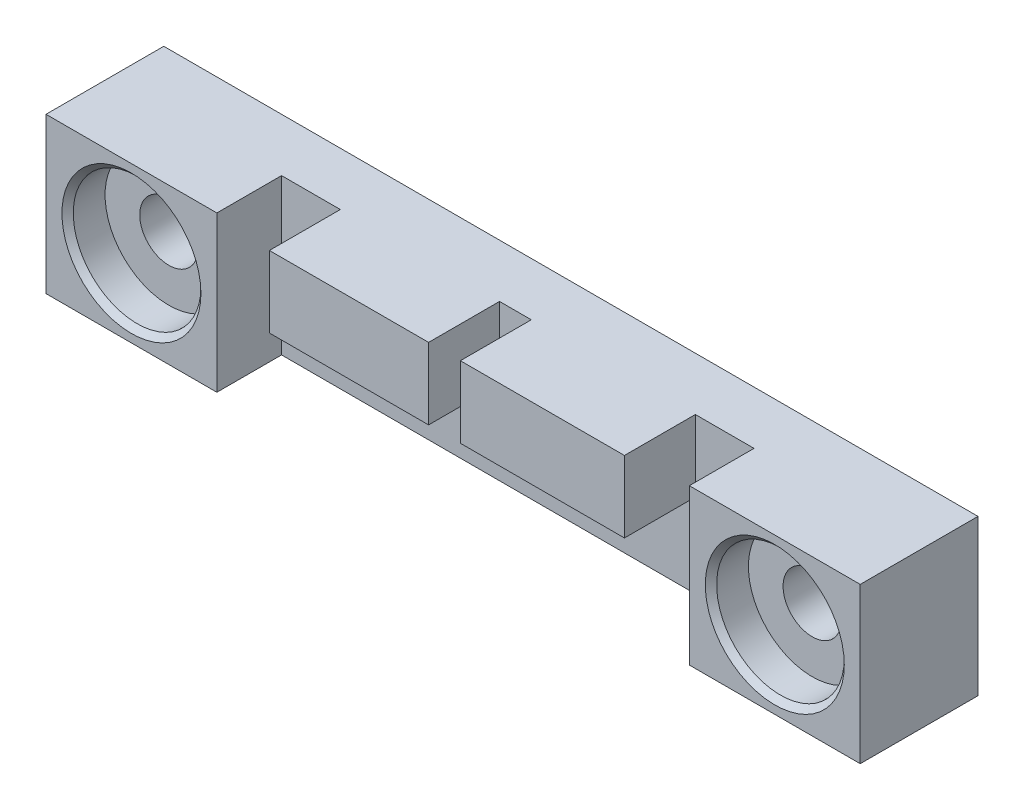
ISO-10303-21;
HEADER;
FILE_DESCRIPTION(('STEP AP214'),'2;1');
FILE_NAME('part.step','',(''),(''),'','','');
FILE_SCHEMA(('AUTOMOTIVE_DESIGN { 1 0 10303 214 1 1 1 1 }'));
ENDSEC;
DATA;
#1=APPLICATION_CONTEXT('core data for automotive mechanical design processes');
#2=APPLICATION_PROTOCOL_DEFINITION('international standard','automotive_design',2000,#1);
#3=PRODUCT_CONTEXT('',#1,'mechanical');
#4=PRODUCT('Part','Part','',(#3));
#5=PRODUCT_RELATED_PRODUCT_CATEGORY('part','',(#4));
#6=PRODUCT_DEFINITION_FORMATION('','',#4);
#7=PRODUCT_DEFINITION_CONTEXT('part definition',#1,'design');
#8=PRODUCT_DEFINITION('design','',#6,#7);
#9=PRODUCT_DEFINITION_SHAPE('','',#8);
#10=(LENGTH_UNIT() NAMED_UNIT(*) SI_UNIT(.MILLI.,.METRE.));
#11=(NAMED_UNIT(*) PLANE_ANGLE_UNIT() SI_UNIT($,.RADIAN.));
#12=(NAMED_UNIT(*) SI_UNIT($,.STERADIAN.) SOLID_ANGLE_UNIT());
#13=UNCERTAINTY_MEASURE_WITH_UNIT(LENGTH_MEASURE(1.E-05),#10,'distance_accuracy_value','');
#14=(GEOMETRIC_REPRESENTATION_CONTEXT(3) GLOBAL_UNCERTAINTY_ASSIGNED_CONTEXT((#13)) GLOBAL_UNIT_ASSIGNED_CONTEXT((#10,
#11,#12)) REPRESENTATION_CONTEXT('',''));
#15=CARTESIAN_POINT('',(0.,0.,0.));
#16=DIRECTION('',(0.,0.,1.));
#17=DIRECTION('',(1.,0.,0.));
#18=AXIS2_PLACEMENT_3D('',#15,#16,#17);
#19=CARTESIAN_POINT('',(0.,0.,5.9436));
#20=DIRECTION('',(0.,0.,1.));
#21=DIRECTION('',(1.,0.,0.));
#22=AXIS2_PLACEMENT_3D('',#19,#20,#21);
#23=PLANE('',#22);
#24=DIRECTION('',(1.,0.,0.));
#25=VECTOR('',#24,1.);
#26=CARTESIAN_POINT('',(-44.0563,9.3853,5.9436));
#27=LINE('',#26,#25);
#28=CARTESIAN_POINT('',(-44.0563,9.3853,5.9436));
#29=VERTEX_POINT('',#28);
#30=CARTESIAN_POINT('',(-25.6921,9.3853,5.9436));
#31=VERTEX_POINT('',#30);
#32=EDGE_CURVE('E47',#29,#31,#27,.T.);
#33=ORIENTED_EDGE('',*,*,#32,.F.);
#34=DIRECTION('',(0.,-1.,0.));
#35=VECTOR('',#34,1.);
#36=CARTESIAN_POINT('',(-44.0563,17.3863,5.9436));
#37=LINE('',#36,#35);
#38=CARTESIAN_POINT('',(-44.0563,17.3863,5.9436));
#39=VERTEX_POINT('',#38);
#40=EDGE_CURVE('E165',#39,#29,#37,.T.);
#41=ORIENTED_EDGE('',*,*,#40,.F.);
#42=DIRECTION('',(-1.,0.,0.));
#43=VECTOR('',#42,1.);
#44=CARTESIAN_POINT('',(-72.009,17.3863,5.9436));
#45=LINE('',#44,#43);
#46=CARTESIAN_POINT('',(-47.6123,17.3863,5.9436));
#47=VERTEX_POINT('',#46);
#48=EDGE_CURVE('E246',#39,#47,#45,.T.);
#49=ORIENTED_EDGE('',*,*,#48,.T.);
#50=DIRECTION('',(0.,1.,0.));
#51=VECTOR('',#50,1.);
#52=CARTESIAN_POINT('',(-47.6123,17.3863,5.9436));
#53=LINE('',#52,#51);
#54=CARTESIAN_POINT('',(-47.6123,9.3853,5.9436));
#55=VERTEX_POINT('',#54);
#56=EDGE_CURVE('E179',#55,#47,#53,.T.);
#57=ORIENTED_EDGE('',*,*,#56,.F.);
#58=DIRECTION('',(1.,0.,0.));
#59=VECTOR('',#58,1.);
#60=CARTESIAN_POINT('',(-65.4304,9.3853,5.9436));
#61=LINE('',#60,#59);
#62=CARTESIAN_POINT('',(-65.4304,9.3853,5.9436));
#63=VERTEX_POINT('',#62);
#64=EDGE_CURVE('E169',#63,#55,#61,.T.);
#65=ORIENTED_EDGE('',*,*,#64,.F.);
#66=DIRECTION('',(0.,-1.,0.));
#67=VECTOR('',#66,1.);
#68=CARTESIAN_POINT('',(-65.4304,17.3863,5.9436));
#69=LINE('',#68,#67);
#70=CARTESIAN_POINT('',(-65.4304,17.3863,5.9436));
#71=VERTEX_POINT('',#70);
#72=EDGE_CURVE('E166',#71,#63,#69,.T.);
#73=ORIENTED_EDGE('',*,*,#72,.F.);
#74=CARTESIAN_POINT('',(-72.009,17.3863,5.9436));
#75=VERTEX_POINT('',#74);
#76=EDGE_CURVE('E242',#71,#75,#45,.T.);
#77=ORIENTED_EDGE('',*,*,#76,.T.);
#78=DIRECTION('',(0.,-1.,0.));
#79=VECTOR('',#78,1.);
#80=CARTESIAN_POINT('',(-72.009,17.3863,5.9436));
#81=LINE('',#80,#79);
#82=CARTESIAN_POINT('',(-72.009,0.,5.9436));
#83=VERTEX_POINT('',#82);
#84=EDGE_CURVE('E232',#75,#83,#81,.T.);
#85=ORIENTED_EDGE('',*,*,#84,.T.);
#86=DIRECTION('',(1.,0.,0.));
#87=VECTOR('',#86,1.);
#88=CARTESIAN_POINT('',(-72.009,0.,5.9436));
#89=LINE('',#88,#87);
#90=CARTESIAN_POINT('',(-19.1262,0.,5.9436));
#91=VERTEX_POINT('',#90);
#92=EDGE_CURVE('E235',#83,#91,#89,.T.);
#93=ORIENTED_EDGE('',*,*,#92,.T.);
#94=DIRECTION('',(0.,1.,0.));
#95=VECTOR('',#94,1.);
#96=CARTESIAN_POINT('',(-19.1262,17.3863,5.9436));
#97=LINE('',#96,#95);
#98=CARTESIAN_POINT('',(-19.1262,17.3863,5.9436));
#99=VERTEX_POINT('',#98);
#100=EDGE_CURVE('E239',#91,#99,#97,.T.);
#101=ORIENTED_EDGE('',*,*,#100,.T.);
#102=CARTESIAN_POINT('',(-25.6921,17.3863,5.9436));
#103=VERTEX_POINT('',#102);
#104=EDGE_CURVE('E243',#99,#103,#45,.T.);
#105=ORIENTED_EDGE('',*,*,#104,.T.);
#106=DIRECTION('',(0.,1.,0.));
#107=VECTOR('',#106,1.);
#108=CARTESIAN_POINT('',(-25.6921,17.3863,5.9436));
#109=LINE('',#108,#107);
#110=EDGE_CURVE('E52',#31,#103,#109,.T.);
#111=ORIENTED_EDGE('',*,*,#110,.F.);
#112=EDGE_LOOP('',(#33,#41,#49,#57,#65,#73,#77,#85,#93,#101,#105,#111));
#113=FACE_BOUND('',#112,.T.);
#114=ADVANCED_FACE('F32',(#113),#23,.T.);
#115=CARTESIAN_POINT('',(0.,0.,13.1826));
#116=DIRECTION('',(0.,0.,1.));
#117=DIRECTION('',(1.,0.,0.));
#118=AXIS2_PLACEMENT_3D('',#115,#116,#117);
#119=PLANE('',#118);
#120=CARTESIAN_POINT('',(-81.5721,8.69315,13.1826));
#121=DIRECTION('',(0.,0.,1.));
#122=DIRECTION('',(1.,0.,0.));
#123=AXIS2_PLACEMENT_3D('',#120,#121,#122);
#124=CIRCLE('',#123,7.77875);
#125=CARTESIAN_POINT('',(-73.79335,8.69315,13.1826));
#126=VERTEX_POINT('',#125);
#127=EDGE_CURVE('E201',#126,#126,#124,.T.);
#128=ORIENTED_EDGE('',*,*,#127,.F.);
#129=EDGE_LOOP('',(#128));
#130=FACE_BOUND('',#129,.T.);
#131=DIRECTION('',(0.,-1.,0.));
#132=VECTOR('',#131,1.);
#133=CARTESIAN_POINT('',(-72.009,17.3863,13.1826));
#134=LINE('',#133,#132);
#135=CARTESIAN_POINT('',(-72.009,17.3863,13.1826));
#136=VERTEX_POINT('',#135);
#137=CARTESIAN_POINT('',(-72.009,0.,13.1826));
#138=VERTEX_POINT('',#137);
#139=EDGE_CURVE('E231',#136,#138,#134,.T.);
#140=ORIENTED_EDGE('',*,*,#139,.F.);
#141=DIRECTION('',(-1.,0.,0.));
#142=VECTOR('',#141,1.);
#143=CARTESIAN_POINT('',(0.,17.3863,13.1826));
#144=LINE('',#143,#142);
#145=CARTESIAN_POINT('',(-91.1352,17.3863,13.1826));
#146=VERTEX_POINT('',#145);
#147=EDGE_CURVE('E262',#136,#146,#144,.T.);
#148=ORIENTED_EDGE('',*,*,#147,.T.);
#149=DIRECTION('',(0.,-1.,0.));
#150=VECTOR('',#149,1.);
#151=CARTESIAN_POINT('',(-91.1352,0.,13.1826));
#152=LINE('',#151,#150);
#153=CARTESIAN_POINT('',(-91.1352,0.,13.1826));
#154=VERTEX_POINT('',#153);
#155=EDGE_CURVE('E267',#146,#154,#152,.T.);
#156=ORIENTED_EDGE('',*,*,#155,.T.);
#157=DIRECTION('',(1.,0.,0.));
#158=VECTOR('',#157,1.);
#159=CARTESIAN_POINT('',(0.,0.,13.1826));
#160=LINE('',#159,#158);
#161=EDGE_CURVE('E270',#154,#138,#160,.T.);
#162=ORIENTED_EDGE('',*,*,#161,.T.);
#163=EDGE_LOOP('',(#140,#148,#156,#162));
#164=FACE_BOUND('',#163,.T.);
#165=ADVANCED_FACE('F323',(#130,#164),#119,.T.);
#166=CARTESIAN_POINT('',(0.,0.,13.1826));
#167=DIRECTION('',(-1.,0.,0.));
#168=DIRECTION('',(0.,0.,1.));
#169=AXIS2_PLACEMENT_3D('',#166,#167,#168);
#170=PLANE('',#169);
#171=DIRECTION('',(0.,1.,0.));
#172=VECTOR('',#171,1.);
#173=CARTESIAN_POINT('',(0.,0.,0.));
#174=LINE('',#173,#172);
#175=CARTESIAN_POINT('',(0.,0.,0.));
#176=VERTEX_POINT('',#175);
#177=CARTESIAN_POINT('',(0.,17.3863,0.));
#178=VERTEX_POINT('',#177);
#179=EDGE_CURVE('E251',#176,#178,#174,.T.);
#180=ORIENTED_EDGE('',*,*,#179,.T.);
#181=DIRECTION('',(0.,0.,-1.));
#182=VECTOR('',#181,1.);
#183=CARTESIAN_POINT('',(0.,17.3863,13.1826));
#184=LINE('',#183,#182);
#185=CARTESIAN_POINT('',(0.,17.3863,13.1826));
#186=VERTEX_POINT('',#185);
#187=EDGE_CURVE('E11',#186,#178,#184,.T.);
#188=ORIENTED_EDGE('',*,*,#187,.F.);
#189=DIRECTION('',(0.,1.,0.));
#190=VECTOR('',#189,1.);
#191=CARTESIAN_POINT('',(0.,0.,13.1826));
#192=LINE('',#191,#190);
#193=CARTESIAN_POINT('',(0.,0.,13.1826));
#194=VERTEX_POINT('',#193);
#195=EDGE_CURVE('E259',#194,#186,#192,.T.);
#196=ORIENTED_EDGE('',*,*,#195,.F.);
#197=DIRECTION('',(0.,0.,-1.));
#198=VECTOR('',#197,1.);
#199=CARTESIAN_POINT('',(0.,0.,13.1826));
#200=LINE('',#199,#198);
#201=EDGE_CURVE('E273',#194,#176,#200,.T.);
#202=ORIENTED_EDGE('',*,*,#201,.T.);
#203=EDGE_LOOP('',(#180,#188,#196,#202));
#204=FACE_BOUND('',#203,.T.);
#205=ADVANCED_FACE('F34',(#204),#170,.F.);
#206=CARTESIAN_POINT('',(0.,17.3863,13.1826));
#207=DIRECTION('',(0.,-1.,0.));
#208=DIRECTION('',(1.,0.,0.));
#209=AXIS2_PLACEMENT_3D('',#206,#207,#208);
#210=PLANE('',#209);
#211=ORIENTED_EDGE('',*,*,#147,.F.);
#212=DIRECTION('',(0.,0.,1.));
#213=VECTOR('',#212,1.);
#214=CARTESIAN_POINT('',(-72.009,17.3863,5.9436));
#215=LINE('',#214,#213);
#216=EDGE_CURVE('E249',#75,#136,#215,.T.);
#217=ORIENTED_EDGE('',*,*,#216,.F.);
#218=ORIENTED_EDGE('',*,*,#76,.F.);
#219=DIRECTION('',(0.,0.,-1.));
#220=VECTOR('',#219,1.);
#221=CARTESIAN_POINT('',(-65.4304,17.3863,13.8811));
#222=LINE('',#221,#220);
#223=CARTESIAN_POINT('',(-65.4304,17.3863,13.8811));
#224=VERTEX_POINT('',#223);
#225=EDGE_CURVE('E184',#224,#71,#222,.T.);
#226=ORIENTED_EDGE('',*,*,#225,.F.);
#227=DIRECTION('',(-1.,0.,0.));
#228=VECTOR('',#227,1.);
#229=CARTESIAN_POINT('',(-65.4304,17.3863,13.8811));
#230=LINE('',#229,#228);
#231=CARTESIAN_POINT('',(-47.6123,17.3863,13.8811));
#232=VERTEX_POINT('',#231);
#233=EDGE_CURVE('E183',#232,#224,#230,.T.);
#234=ORIENTED_EDGE('',*,*,#233,.F.);
#235=DIRECTION('',(0.,0.,-1.));
#236=VECTOR('',#235,1.);
#237=CARTESIAN_POINT('',(-47.6123,17.3863,13.8811));
#238=LINE('',#237,#236);
#239=EDGE_CURVE('E192',#232,#47,#238,.T.);
#240=ORIENTED_EDGE('',*,*,#239,.T.);
#241=ORIENTED_EDGE('',*,*,#48,.F.);
#242=DIRECTION('',(0.,0.,-1.));
#243=VECTOR('',#242,1.);
#244=CARTESIAN_POINT('',(-44.0563,17.3863,13.8811));
#245=LINE('',#244,#243);
#246=CARTESIAN_POINT('',(-44.0563,17.3863,13.8811));
#247=VERTEX_POINT('',#246);
#248=EDGE_CURVE('E528',#247,#39,#245,.T.);
#249=ORIENTED_EDGE('',*,*,#248,.F.);
#250=DIRECTION('',(-1.,0.,0.));
#251=VECTOR('',#250,1.);
#252=CARTESIAN_POINT('',(-44.0563,17.3863,13.8811));
#253=LINE('',#252,#251);
#254=CARTESIAN_POINT('',(-25.6921,17.3863,13.8811));
#255=VERTEX_POINT('',#254);
#256=EDGE_CURVE('E159',#255,#247,#253,.T.);
#257=ORIENTED_EDGE('',*,*,#256,.F.);
#258=DIRECTION('',(0.,0.,-1.));
#259=VECTOR('',#258,1.);
#260=CARTESIAN_POINT('',(-25.6921,17.3863,13.8811));
#261=LINE('',#260,#259);
#262=EDGE_CURVE('E171',#255,#103,#261,.T.);
#263=ORIENTED_EDGE('',*,*,#262,.T.);
#264=ORIENTED_EDGE('',*,*,#104,.F.);
#265=DIRECTION('',(0.,0.,1.));
#266=VECTOR('',#265,1.);
#267=CARTESIAN_POINT('',(-19.1262,17.3863,5.9436));
#268=LINE('',#267,#266);
#269=CARTESIAN_POINT('',(-19.1262,17.3863,13.1826));
#270=VERTEX_POINT('',#269);
#271=EDGE_CURVE('E252',#99,#270,#268,.T.);
#272=ORIENTED_EDGE('',*,*,#271,.T.);
#273=EDGE_CURVE('E264',#186,#270,#144,.T.);
#274=ORIENTED_EDGE('',*,*,#273,.F.);
#275=ORIENTED_EDGE('',*,*,#187,.T.);
#276=DIRECTION('',(-1.,0.,0.));
#277=VECTOR('',#276,1.);
#278=CARTESIAN_POINT('',(0.,17.3863,0.));
#279=LINE('',#278,#277);
#280=CARTESIAN_POINT('',(-91.1352,17.3863,0.));
#281=VERTEX_POINT('',#280);
#282=EDGE_CURVE('E276',#178,#281,#279,.T.);
#283=ORIENTED_EDGE('',*,*,#282,.T.);
#284=DIRECTION('',(0.,0.,-1.));
#285=VECTOR('',#284,1.);
#286=CARTESIAN_POINT('',(-91.1352,17.3863,13.1826));
#287=LINE('',#286,#285);
#288=EDGE_CURVE('E40',#146,#281,#287,.T.);
#289=ORIENTED_EDGE('',*,*,#288,.F.);
#290=EDGE_LOOP('',(#211,#217,#218,#226,#234,#240,#241,#249,#257,#263,#264,#272,#274,#275,#283,#289));
#291=FACE_BOUND('',#290,.T.);
#292=ADVANCED_FACE('F320',(#291),#210,.F.);
#293=CARTESIAN_POINT('',(-91.1352,0.,13.1826));
#294=DIRECTION('',(1.,0.,0.));
#295=DIRECTION('',(0.,0.,-1.));
#296=AXIS2_PLACEMENT_3D('',#293,#294,#295);
#297=PLANE('',#296);
#298=DIRECTION('',(0.,-1.,0.));
#299=VECTOR('',#298,1.);
#300=CARTESIAN_POINT('',(-91.1352,0.,0.));
#301=LINE('',#300,#299);
#302=CARTESIAN_POINT('',(-91.1352,0.,0.));
#303=VERTEX_POINT('',#302);
#304=EDGE_CURVE('E278',#281,#303,#301,.T.);
#305=ORIENTED_EDGE('',*,*,#304,.T.);
#306=DIRECTION('',(0.,0.,-1.));
#307=VECTOR('',#306,1.);
#308=CARTESIAN_POINT('',(-91.1352,0.,13.1826));
#309=LINE('',#308,#307);
#310=EDGE_CURVE('E283',#154,#303,#309,.T.);
#311=ORIENTED_EDGE('',*,*,#310,.F.);
#312=ORIENTED_EDGE('',*,*,#155,.F.);
#313=ORIENTED_EDGE('',*,*,#288,.T.);
#314=EDGE_LOOP('',(#305,#311,#312,#313));
#315=FACE_BOUND('',#314,.T.);
#316=ADVANCED_FACE('F290',(#315),#297,.F.);
#317=CARTESIAN_POINT('',(0.,0.,13.1826));
#318=DIRECTION('',(0.,1.,0.));
#319=DIRECTION('',(0.,0.,1.));
#320=AXIS2_PLACEMENT_3D('',#317,#318,#319);
#321=PLANE('',#320);
#322=ORIENTED_EDGE('',*,*,#92,.F.);
#323=DIRECTION('',(0.,0.,1.));
#324=VECTOR('',#323,1.);
#325=CARTESIAN_POINT('',(-72.009,0.,5.9436));
#326=LINE('',#325,#324);
#327=EDGE_CURVE('E245',#83,#138,#326,.T.);
#328=ORIENTED_EDGE('',*,*,#327,.T.);
#329=ORIENTED_EDGE('',*,*,#161,.F.);
#330=ORIENTED_EDGE('',*,*,#310,.T.);
#331=DIRECTION('',(1.,0.,0.));
#332=VECTOR('',#331,1.);
#333=CARTESIAN_POINT('',(0.,0.,0.));
#334=LINE('',#333,#332);
#335=EDGE_CURVE('E263',#303,#176,#334,.T.);
#336=ORIENTED_EDGE('',*,*,#335,.T.);
#337=ORIENTED_EDGE('',*,*,#201,.F.);
#338=CARTESIAN_POINT('',(-19.1262,0.,13.1826));
#339=VERTEX_POINT('',#338);
#340=EDGE_CURVE('E269',#339,#194,#160,.T.);
#341=ORIENTED_EDGE('',*,*,#340,.F.);
#342=DIRECTION('',(0.,0.,1.));
#343=VECTOR('',#342,1.);
#344=CARTESIAN_POINT('',(-19.1262,0.,5.9436));
#345=LINE('',#344,#343);
#346=EDGE_CURVE('E255',#91,#339,#345,.T.);
#347=ORIENTED_EDGE('',*,*,#346,.F.);
#348=EDGE_LOOP('',(#322,#328,#329,#330,#336,#337,#341,#347));
#349=FACE_BOUND('',#348,.T.);
#350=ADVANCED_FACE('F301',(#349),#321,.F.);
#351=CARTESIAN_POINT('',(-9.5631,8.69315,13.1826));
#352=DIRECTION('',(0.,0.,1.));
#353=DIRECTION('',(1.,0.,0.));
#354=AXIS2_PLACEMENT_3D('',#351,#352,#353);
#355=CIRCLE('',#354,7.77875);
#356=CARTESIAN_POINT('',(-1.78435,8.69315,13.1826));
#357=VERTEX_POINT('',#356);
#358=EDGE_CURVE('E216',#357,#357,#355,.T.);
#359=ORIENTED_EDGE('',*,*,#358,.F.);
#360=EDGE_LOOP('',(#359));
#361=FACE_BOUND('',#360,.T.);
#362=DIRECTION('',(0.,1.,0.));
#363=VECTOR('',#362,1.);
#364=CARTESIAN_POINT('',(-19.1262,17.3863,13.1826));
#365=LINE('',#364,#363);
#366=EDGE_CURVE('E236',#339,#270,#365,.T.);
#367=ORIENTED_EDGE('',*,*,#366,.F.);
#368=ORIENTED_EDGE('',*,*,#340,.T.);
#369=ORIENTED_EDGE('',*,*,#195,.T.);
#370=ORIENTED_EDGE('',*,*,#273,.T.);
#371=EDGE_LOOP('',(#367,#368,#369,#370));
#372=FACE_BOUND('',#371,.T.);
#373=ADVANCED_FACE('F309',(#361,#372),#119,.T.);
#374=CARTESIAN_POINT('',(0.,0.,0.));
#375=DIRECTION('',(0.,0.,1.));
#376=DIRECTION('',(1.,0.,0.));
#377=AXIS2_PLACEMENT_3D('',#374,#375,#376);
#378=PLANE('',#377);
#379=CARTESIAN_POINT('',(-81.5721,8.69315,0.));
#380=DIRECTION('',(0.,0.,1.));
#381=DIRECTION('',(1.,0.,0.));
#382=AXIS2_PLACEMENT_3D('',#379,#380,#381);
#383=CIRCLE('',#382,3.2639);
#384=CARTESIAN_POINT('',(-78.3082,8.69315,0.));
#385=VERTEX_POINT('',#384);
#386=EDGE_CURVE('E213',#385,#385,#383,.T.);
#387=ORIENTED_EDGE('',*,*,#386,.T.);
#388=EDGE_LOOP('',(#387));
#389=FACE_BOUND('',#388,.T.);
#390=CARTESIAN_POINT('',(-9.5631,8.69315,0.));
#391=DIRECTION('',(0.,0.,1.));
#392=DIRECTION('',(1.,0.,0.));
#393=AXIS2_PLACEMENT_3D('',#390,#391,#392);
#394=CIRCLE('',#393,3.2639);
#395=CARTESIAN_POINT('',(-6.2992,8.69315,0.));
#396=VERTEX_POINT('',#395);
#397=EDGE_CURVE('E228',#396,#396,#394,.T.);
#398=ORIENTED_EDGE('',*,*,#397,.T.);
#399=EDGE_LOOP('',(#398));
#400=FACE_BOUND('',#399,.T.);
#401=ORIENTED_EDGE('',*,*,#179,.F.);
#402=ORIENTED_EDGE('',*,*,#335,.F.);
#403=ORIENTED_EDGE('',*,*,#304,.F.);
#404=ORIENTED_EDGE('',*,*,#282,.F.);
#405=EDGE_LOOP('',(#401,#402,#403,#404));
#406=FACE_BOUND('',#405,.T.);
#407=ADVANCED_FACE('F297',(#389,#400,#406),#378,.F.);
#408=CARTESIAN_POINT('',(-72.009,17.3863,5.9436));
#409=DIRECTION('',(-1.,0.,0.));
#410=DIRECTION('',(0.,0.,1.));
#411=AXIS2_PLACEMENT_3D('',#408,#409,#410);
#412=PLANE('',#411);
#413=ORIENTED_EDGE('',*,*,#139,.T.);
#414=ORIENTED_EDGE('',*,*,#327,.F.);
#415=ORIENTED_EDGE('',*,*,#84,.F.);
#416=ORIENTED_EDGE('',*,*,#216,.T.);
#417=EDGE_LOOP('',(#413,#414,#415,#416));
#418=FACE_BOUND('',#417,.T.);
#419=ADVANCED_FACE('F318',(#418),#412,.F.);
#420=CARTESIAN_POINT('',(-19.1262,17.3863,5.9436));
#421=DIRECTION('',(1.,0.,0.));
#422=DIRECTION('',(0.,1.,0.));
#423=AXIS2_PLACEMENT_3D('',#420,#421,#422);
#424=PLANE('',#423);
#425=ORIENTED_EDGE('',*,*,#366,.T.);
#426=ORIENTED_EDGE('',*,*,#271,.F.);
#427=ORIENTED_EDGE('',*,*,#100,.F.);
#428=ORIENTED_EDGE('',*,*,#346,.T.);
#429=EDGE_LOOP('',(#425,#426,#427,#428));
#430=FACE_BOUND('',#429,.T.);
#431=ADVANCED_FACE('F312',(#430),#424,.F.);
#432=CARTESIAN_POINT('',(-9.5631,8.69315,13.1826));
#433=DIRECTION('',(0.,0.,1.));
#434=DIRECTION('',(1.,0.,0.));
#435=AXIS2_PLACEMENT_3D('',#432,#433,#434);
#436=CYLINDRICAL_SURFACE('',#435,3.2639);
#437=ORIENTED_EDGE('',*,*,#397,.F.);
#438=EDGE_LOOP('',(#437));
#439=FACE_BOUND('',#438,.T.);
#440=CARTESIAN_POINT('',(-9.5631,8.69315,8.9916));
#441=DIRECTION('',(0.,0.,1.));
#442=DIRECTION('',(1.,0.,0.));
#443=AXIS2_PLACEMENT_3D('',#440,#441,#442);
#444=CIRCLE('',#443,3.2639);
#445=CARTESIAN_POINT('',(-6.2992,8.69315,8.9916));
#446=VERTEX_POINT('',#445);
#447=EDGE_CURVE('E225',#446,#446,#444,.T.);
#448=ORIENTED_EDGE('',*,*,#447,.T.);
#449=EDGE_LOOP('',(#448));
#450=FACE_BOUND('',#449,.T.);
#451=ADVANCED_FACE('F366',(#439,#450),#436,.F.);
#452=CARTESIAN_POINT('',(-2.41935,8.69315,8.9916));
#453=DIRECTION('',(0.,0.,-1.));
#454=DIRECTION('',(-1.,0.,0.));
#455=AXIS2_PLACEMENT_3D('',#452,#453,#454);
#456=PLANE('',#455);
#457=ORIENTED_EDGE('',*,*,#447,.F.);
#458=EDGE_LOOP('',(#457));
#459=FACE_BOUND('',#458,.T.);
#460=CARTESIAN_POINT('',(-9.5631,8.69315,8.9916));
#461=DIRECTION('',(0.,0.,1.));
#462=DIRECTION('',(1.,0.,0.));
#463=AXIS2_PLACEMENT_3D('',#460,#461,#462);
#464=CIRCLE('',#463,7.14375);
#465=CARTESIAN_POINT('',(-2.41935,8.69315,8.9916));
#466=VERTEX_POINT('',#465);
#467=EDGE_CURVE('E222',#466,#466,#464,.T.);
#468=ORIENTED_EDGE('',*,*,#467,.T.);
#469=EDGE_LOOP('',(#468));
#470=FACE_BOUND('',#469,.T.);
#471=ADVANCED_FACE('F358',(#459,#470),#456,.F.);
#472=CARTESIAN_POINT('',(-9.5631,8.69315,13.1826));
#473=DIRECTION('',(0.,0.,1.));
#474=DIRECTION('',(1.,0.,0.));
#475=AXIS2_PLACEMENT_3D('',#472,#473,#474);
#476=CYLINDRICAL_SURFACE('',#475,7.14375);
#477=ORIENTED_EDGE('',*,*,#467,.F.);
#478=EDGE_LOOP('',(#477));
#479=FACE_BOUND('',#478,.T.);
#480=CARTESIAN_POINT('',(-9.5631,8.69315,12.5476));
#481=DIRECTION('',(0.,0.,1.));
#482=DIRECTION('',(1.,0.,0.));
#483=AXIS2_PLACEMENT_3D('',#480,#481,#482);
#484=CIRCLE('',#483,7.14375);
#485=CARTESIAN_POINT('',(-2.41935,8.69315,12.5476));
#486=VERTEX_POINT('',#485);
#487=EDGE_CURVE('E219',#486,#486,#484,.T.);
#488=ORIENTED_EDGE('',*,*,#487,.T.);
#489=EDGE_LOOP('',(#488));
#490=FACE_BOUND('',#489,.T.);
#491=ADVANCED_FACE('F348',(#479,#490),#476,.F.);
#492=CARTESIAN_POINT('',(-9.5631,8.69315,13.1826));
#493=DIRECTION('',(0.,0.,1.));
#494=DIRECTION('',(1.,0.,0.));
#495=AXIS2_PLACEMENT_3D('',#492,#493,#494);
#496=CONICAL_SURFACE('',#495,7.77875,0.785398163397448);
#497=ORIENTED_EDGE('',*,*,#487,.F.);
#498=EDGE_LOOP('',(#497));
#499=FACE_BOUND('',#498,.T.);
#500=ORIENTED_EDGE('',*,*,#358,.T.);
#501=EDGE_LOOP('',(#500));
#502=FACE_BOUND('',#501,.T.);
#503=ADVANCED_FACE('F345',(#499,#502),#496,.F.);
#504=CARTESIAN_POINT('',(-81.5721,8.69315,13.1826));
#505=DIRECTION('',(0.,0.,1.));
#506=DIRECTION('',(1.,0.,0.));
#507=AXIS2_PLACEMENT_3D('',#504,#505,#506);
#508=CYLINDRICAL_SURFACE('',#507,3.2639);
#509=ORIENTED_EDGE('',*,*,#386,.F.);
#510=EDGE_LOOP('',(#509));
#511=FACE_BOUND('',#510,.T.);
#512=CARTESIAN_POINT('',(-81.5721,8.69315,8.9916));
#513=DIRECTION('',(0.,0.,1.));
#514=DIRECTION('',(1.,0.,0.));
#515=AXIS2_PLACEMENT_3D('',#512,#513,#514);
#516=CIRCLE('',#515,3.2639);
#517=CARTESIAN_POINT('',(-78.3082,8.69315,8.9916));
#518=VERTEX_POINT('',#517);
#519=EDGE_CURVE('E210',#518,#518,#516,.T.);
#520=ORIENTED_EDGE('',*,*,#519,.T.);
#521=EDGE_LOOP('',(#520));
#522=FACE_BOUND('',#521,.T.);
#523=ADVANCED_FACE('F347',(#511,#522),#508,.F.);
#524=CARTESIAN_POINT('',(-74.42835,8.69315,8.9916));
#525=DIRECTION('',(0.,0.,-1.));
#526=DIRECTION('',(-1.,0.,0.));
#527=AXIS2_PLACEMENT_3D('',#524,#525,#526);
#528=PLANE('',#527);
#529=ORIENTED_EDGE('',*,*,#519,.F.);
#530=EDGE_LOOP('',(#529));
#531=FACE_BOUND('',#530,.T.);
#532=CARTESIAN_POINT('',(-81.5721,8.69315,8.9916));
#533=DIRECTION('',(0.,0.,1.));
#534=DIRECTION('',(1.,0.,0.));
#535=AXIS2_PLACEMENT_3D('',#532,#533,#534);
#536=CIRCLE('',#535,7.14375);
#537=CARTESIAN_POINT('',(-74.42835,8.69315,8.9916));
#538=VERTEX_POINT('',#537);
#539=EDGE_CURVE('E207',#538,#538,#536,.T.);
#540=ORIENTED_EDGE('',*,*,#539,.T.);
#541=EDGE_LOOP('',(#540));
#542=FACE_BOUND('',#541,.T.);
#543=ADVANCED_FACE('F355',(#531,#542),#528,.F.);
#544=CARTESIAN_POINT('',(-81.5721,8.69315,13.1826));
#545=DIRECTION('',(0.,0.,1.));
#546=DIRECTION('',(1.,0.,0.));
#547=AXIS2_PLACEMENT_3D('',#544,#545,#546);
#548=CYLINDRICAL_SURFACE('',#547,7.14375);
#549=ORIENTED_EDGE('',*,*,#539,.F.);
#550=EDGE_LOOP('',(#549));
#551=FACE_BOUND('',#550,.T.);
#552=CARTESIAN_POINT('',(-81.5721,8.69315,12.5476));
#553=DIRECTION('',(0.,0.,1.));
#554=DIRECTION('',(1.,0.,0.));
#555=AXIS2_PLACEMENT_3D('',#552,#553,#554);
#556=CIRCLE('',#555,7.14375);
#557=CARTESIAN_POINT('',(-74.42835,8.69315,12.5476));
#558=VERTEX_POINT('',#557);
#559=EDGE_CURVE('E204',#558,#558,#556,.T.);
#560=ORIENTED_EDGE('',*,*,#559,.T.);
#561=EDGE_LOOP('',(#560));
#562=FACE_BOUND('',#561,.T.);
#563=ADVANCED_FACE('F413',(#551,#562),#548,.F.);
#564=CARTESIAN_POINT('',(-81.5721,8.69315,13.1826));
#565=DIRECTION('',(0.,0.,1.));
#566=DIRECTION('',(1.,0.,0.));
#567=AXIS2_PLACEMENT_3D('',#564,#565,#566);
#568=CONICAL_SURFACE('',#567,7.77875,0.785398163397443);
#569=ORIENTED_EDGE('',*,*,#559,.F.);
#570=EDGE_LOOP('',(#569));
#571=FACE_BOUND('',#570,.T.);
#572=ORIENTED_EDGE('',*,*,#127,.T.);
#573=EDGE_LOOP('',(#572));
#574=FACE_BOUND('',#573,.T.);
#575=ADVANCED_FACE('F422',(#571,#574),#568,.F.);
#576=CARTESIAN_POINT('',(-65.4304,17.3863,13.8811));
#577=DIRECTION('',(1.,0.,0.));
#578=DIRECTION('',(0.,0.,-1.));
#579=AXIS2_PLACEMENT_3D('',#576,#577,#578);
#580=PLANE('',#579);
#581=ORIENTED_EDGE('',*,*,#72,.T.);
#582=DIRECTION('',(0.,0.,-1.));
#583=VECTOR('',#582,1.);
#584=CARTESIAN_POINT('',(-65.4304,9.3853,13.8811));
#585=LINE('',#584,#583);
#586=CARTESIAN_POINT('',(-65.4304,9.3853,13.8811));
#587=VERTEX_POINT('',#586);
#588=EDGE_CURVE('E198',#587,#63,#585,.T.);
#589=ORIENTED_EDGE('',*,*,#588,.F.);
#590=DIRECTION('',(0.,-1.,0.));
#591=VECTOR('',#590,1.);
#592=CARTESIAN_POINT('',(-65.4304,17.3863,13.8811));
#593=LINE('',#592,#591);
#594=EDGE_CURVE('E175',#224,#587,#593,.T.);
#595=ORIENTED_EDGE('',*,*,#594,.F.);
#596=ORIENTED_EDGE('',*,*,#225,.T.);
#597=EDGE_LOOP('',(#581,#589,#595,#596));
#598=FACE_BOUND('',#597,.T.);
#599=ADVANCED_FACE('F432',(#598),#580,.F.);
#600=CARTESIAN_POINT('',(-65.4304,9.3853,13.8811));
#601=DIRECTION('',(0.,1.,0.));
#602=DIRECTION('',(0.,0.,1.));
#603=AXIS2_PLACEMENT_3D('',#600,#601,#602);
#604=PLANE('',#603);
#605=ORIENTED_EDGE('',*,*,#64,.T.);
#606=DIRECTION('',(0.,0.,-1.));
#607=VECTOR('',#606,1.);
#608=CARTESIAN_POINT('',(-47.6123,9.3853,13.8811));
#609=LINE('',#608,#607);
#610=CARTESIAN_POINT('',(-47.6123,9.3853,13.8811));
#611=VERTEX_POINT('',#610);
#612=EDGE_CURVE('E195',#611,#55,#609,.T.);
#613=ORIENTED_EDGE('',*,*,#612,.F.);
#614=DIRECTION('',(1.,0.,0.));
#615=VECTOR('',#614,1.);
#616=CARTESIAN_POINT('',(-65.4304,9.3853,13.8811));
#617=LINE('',#616,#615);
#618=EDGE_CURVE('E178',#587,#611,#617,.T.);
#619=ORIENTED_EDGE('',*,*,#618,.F.);
#620=ORIENTED_EDGE('',*,*,#588,.T.);
#621=EDGE_LOOP('',(#605,#613,#619,#620));
#622=FACE_BOUND('',#621,.T.);
#623=ADVANCED_FACE('F457',(#622),#604,.F.);
#624=CARTESIAN_POINT('',(-47.6123,17.3863,13.8811));
#625=DIRECTION('',(-1.,0.,0.));
#626=DIRECTION('',(0.,0.,1.));
#627=AXIS2_PLACEMENT_3D('',#624,#625,#626);
#628=PLANE('',#627);
#629=ORIENTED_EDGE('',*,*,#56,.T.);
#630=ORIENTED_EDGE('',*,*,#239,.F.);
#631=DIRECTION('',(0.,1.,0.));
#632=VECTOR('',#631,1.);
#633=CARTESIAN_POINT('',(-47.6123,17.3863,13.8811));
#634=LINE('',#633,#632);
#635=EDGE_CURVE('E181',#611,#232,#634,.T.);
#636=ORIENTED_EDGE('',*,*,#635,.F.);
#637=ORIENTED_EDGE('',*,*,#612,.T.);
#638=EDGE_LOOP('',(#629,#630,#636,#637));
#639=FACE_BOUND('',#638,.T.);
#640=ADVANCED_FACE('F467',(#639),#628,.F.);
#641=CARTESIAN_POINT('',(0.,0.,13.8811));
#642=DIRECTION('',(0.,0.,1.));
#643=DIRECTION('',(1.,0.,0.));
#644=AXIS2_PLACEMENT_3D('',#641,#642,#643);
#645=PLANE('',#644);
#646=ORIENTED_EDGE('',*,*,#594,.T.);
#647=ORIENTED_EDGE('',*,*,#618,.T.);
#648=ORIENTED_EDGE('',*,*,#635,.T.);
#649=ORIENTED_EDGE('',*,*,#233,.T.);
#650=EDGE_LOOP('',(#646,#647,#648,#649));
#651=FACE_BOUND('',#650,.T.);
#652=ADVANCED_FACE('F477',(#651),#645,.T.);
#653=CARTESIAN_POINT('',(-44.0563,17.3863,13.8811));
#654=DIRECTION('',(1.,0.,0.));
#655=DIRECTION('',(0.,0.,-1.));
#656=AXIS2_PLACEMENT_3D('',#653,#654,#655);
#657=PLANE('',#656);
#658=ORIENTED_EDGE('',*,*,#40,.T.);
#659=DIRECTION('',(0.,0.,-1.));
#660=VECTOR('',#659,1.);
#661=CARTESIAN_POINT('',(-44.0563,9.3853,13.8811));
#662=LINE('',#661,#660);
#663=CARTESIAN_POINT('',(-44.0563,9.3853,13.8811));
#664=VERTEX_POINT('',#663);
#665=EDGE_CURVE('E147',#664,#29,#662,.T.);
#666=ORIENTED_EDGE('',*,*,#665,.F.);
#667=DIRECTION('',(0.,-1.,0.));
#668=VECTOR('',#667,1.);
#669=CARTESIAN_POINT('',(-44.0563,17.3863,13.8811));
#670=LINE('',#669,#668);
#671=EDGE_CURVE('E154',#247,#664,#670,.T.);
#672=ORIENTED_EDGE('',*,*,#671,.F.);
#673=ORIENTED_EDGE('',*,*,#248,.T.);
#674=EDGE_LOOP('',(#658,#666,#672,#673));
#675=FACE_BOUND('',#674,.T.);
#676=ADVANCED_FACE('F164',(#675),#657,.F.);
#677=CARTESIAN_POINT('',(-44.0563,9.3853,13.8811));
#678=DIRECTION('',(0.,1.,0.));
#679=DIRECTION('',(-1.,0.,0.));
#680=AXIS2_PLACEMENT_3D('',#677,#678,#679);
#681=PLANE('',#680);
#682=ORIENTED_EDGE('',*,*,#32,.T.);
#683=DIRECTION('',(0.,0.,-1.));
#684=VECTOR('',#683,1.);
#685=CARTESIAN_POINT('',(-25.6921,9.3853,13.8811));
#686=LINE('',#685,#684);
#687=CARTESIAN_POINT('',(-25.6921,9.3853,13.8811));
#688=VERTEX_POINT('',#687);
#689=EDGE_CURVE('E150',#688,#31,#686,.T.);
#690=ORIENTED_EDGE('',*,*,#689,.F.);
#691=DIRECTION('',(1.,0.,0.));
#692=VECTOR('',#691,1.);
#693=CARTESIAN_POINT('',(-44.0563,9.3853,13.8811));
#694=LINE('',#693,#692);
#695=EDGE_CURVE('E143',#664,#688,#694,.T.);
#696=ORIENTED_EDGE('',*,*,#695,.F.);
#697=ORIENTED_EDGE('',*,*,#665,.T.);
#698=EDGE_LOOP('',(#682,#690,#696,#697));
#699=FACE_BOUND('',#698,.T.);
#700=ADVANCED_FACE('F145',(#699),#681,.F.);
#701=CARTESIAN_POINT('',(-25.6921,17.3863,13.8811));
#702=DIRECTION('',(-1.,0.,0.));
#703=DIRECTION('',(0.,0.,1.));
#704=AXIS2_PLACEMENT_3D('',#701,#702,#703);
#705=PLANE('',#704);
#706=ORIENTED_EDGE('',*,*,#110,.T.);
#707=ORIENTED_EDGE('',*,*,#262,.F.);
#708=DIRECTION('',(0.,1.,0.));
#709=VECTOR('',#708,1.);
#710=CARTESIAN_POINT('',(-25.6921,17.3863,13.8811));
#711=LINE('',#710,#709);
#712=EDGE_CURVE('E153',#688,#255,#711,.T.);
#713=ORIENTED_EDGE('',*,*,#712,.F.);
#714=ORIENTED_EDGE('',*,*,#689,.T.);
#715=EDGE_LOOP('',(#706,#707,#713,#714));
#716=FACE_BOUND('',#715,.T.);
#717=ADVANCED_FACE('F504',(#716),#705,.F.);
#718=CARTESIAN_POINT('',(0.,0.,13.8811));
#719=DIRECTION('',(0.,0.,1.));
#720=DIRECTION('',(1.,0.,0.));
#721=AXIS2_PLACEMENT_3D('',#718,#719,#720);
#722=PLANE('',#721);
#723=ORIENTED_EDGE('',*,*,#671,.T.);
#724=ORIENTED_EDGE('',*,*,#695,.T.);
#725=ORIENTED_EDGE('',*,*,#712,.T.);
#726=ORIENTED_EDGE('',*,*,#256,.T.);
#727=EDGE_LOOP('',(#723,#724,#725,#726));
#728=FACE_BOUND('',#727,.T.);
#729=ADVANCED_FACE('F157',(#728),#722,.T.);
#730=CLOSED_SHELL('',(#114,#165,#205,#292,#316,#350,#373,#407,#419,#431,#451,#471,#491,#503,
#523,#543,#563,#575,#599,#623,#640,#652,#676,#700,#717,#729));
#731=MANIFOLD_SOLID_BREP('B2',#730);
#732=ADVANCED_BREP_SHAPE_REPRESENTATION('',(#18,#731),#14);
#733=SHAPE_DEFINITION_REPRESENTATION(#9,#732);
ENDSEC;
END-ISO-10303-21;
